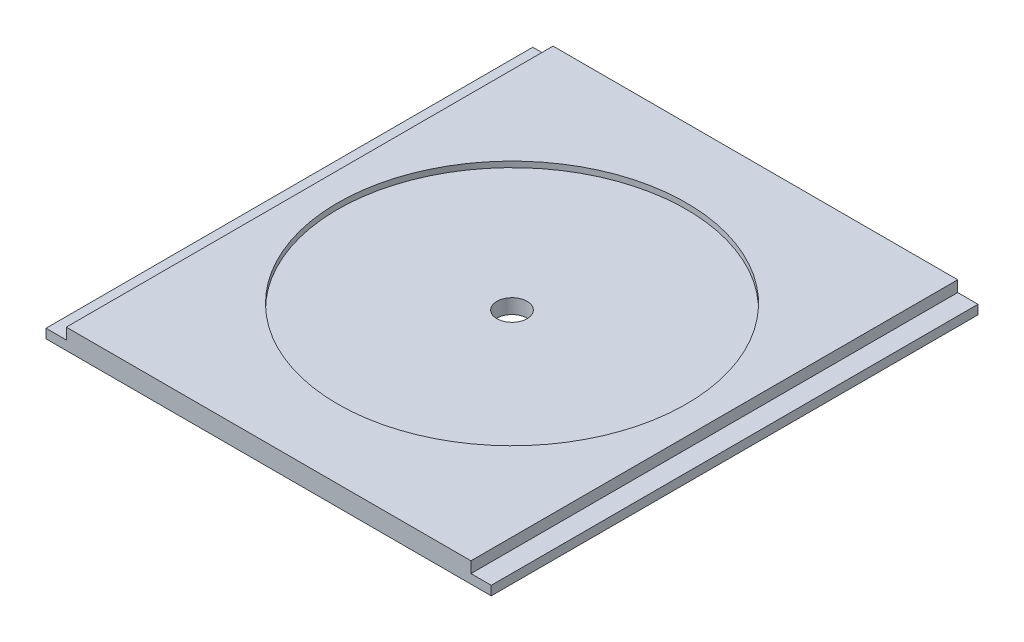
ISO-10303-21;
HEADER;
FILE_DESCRIPTION(('STEP AP214'),'2;1');
FILE_NAME('part.step','',(''),(''),'','','');
FILE_SCHEMA(('AUTOMOTIVE_DESIGN { 1 0 10303 214 1 1 1 1 }'));
ENDSEC;
DATA;
#1=APPLICATION_CONTEXT('core data for automotive mechanical design processes');
#2=APPLICATION_PROTOCOL_DEFINITION('international standard','automotive_design',2000,#1);
#3=PRODUCT_CONTEXT('',#1,'mechanical');
#4=PRODUCT('Part','Part','',(#3));
#5=PRODUCT_RELATED_PRODUCT_CATEGORY('part','',(#4));
#6=PRODUCT_DEFINITION_FORMATION('','',#4);
#7=PRODUCT_DEFINITION_CONTEXT('part definition',#1,'design');
#8=PRODUCT_DEFINITION('design','',#6,#7);
#9=PRODUCT_DEFINITION_SHAPE('','',#8);
#10=(LENGTH_UNIT() NAMED_UNIT(*) SI_UNIT(.MILLI.,.METRE.));
#11=(NAMED_UNIT(*) PLANE_ANGLE_UNIT() SI_UNIT($,.RADIAN.));
#12=(NAMED_UNIT(*) SI_UNIT($,.STERADIAN.) SOLID_ANGLE_UNIT());
#13=UNCERTAINTY_MEASURE_WITH_UNIT(LENGTH_MEASURE(1.E-05),#10,'distance_accuracy_value','');
#14=(GEOMETRIC_REPRESENTATION_CONTEXT(3) GLOBAL_UNCERTAINTY_ASSIGNED_CONTEXT((#13)) GLOBAL_UNIT_ASSIGNED_CONTEXT((#10,
#11,#12)) REPRESENTATION_CONTEXT('',''));
#15=CARTESIAN_POINT('',(0.,0.,0.));
#16=DIRECTION('',(0.,0.,1.));
#17=DIRECTION('',(1.,0.,0.));
#18=AXIS2_PLACEMENT_3D('',#15,#16,#17);
#19=CARTESIAN_POINT('',(0.,6.35,0.));
#20=DIRECTION('',(1.,0.,0.));
#21=DIRECTION('',(0.,0.,-1.));
#22=AXIS2_PLACEMENT_3D('',#19,#20,#21);
#23=PLANE('',#22);
#24=DIRECTION('',(0.,0.,1.));
#25=VECTOR('',#24,1.);
#26=CARTESIAN_POINT('',(0.,2.87528,-152.4));
#27=LINE('',#26,#25);
#28=CARTESIAN_POINT('',(0.,2.87528,-152.4));
#29=VERTEX_POINT('',#28);
#30=CARTESIAN_POINT('',(0.,2.87528,0.));
#31=VERTEX_POINT('',#30);
#32=EDGE_CURVE('E101',#29,#31,#27,.T.);
#33=ORIENTED_EDGE('',*,*,#32,.F.);
#34=DIRECTION('',(0.,-1.,0.));
#35=VECTOR('',#34,1.);
#36=CARTESIAN_POINT('',(0.,6.35,-152.4));
#37=LINE('',#36,#35);
#38=CARTESIAN_POINT('',(0.,0.,-152.4));
#39=VERTEX_POINT('',#38);
#40=EDGE_CURVE('E123',#29,#39,#37,.T.);
#41=ORIENTED_EDGE('',*,*,#40,.T.);
#42=DIRECTION('',(0.,0.,1.));
#43=VECTOR('',#42,1.);
#44=CARTESIAN_POINT('',(0.,0.,0.));
#45=LINE('',#44,#43);
#46=CARTESIAN_POINT('',(0.,0.,0.));
#47=VERTEX_POINT('',#46);
#48=EDGE_CURVE('E122',#39,#47,#45,.T.);
#49=ORIENTED_EDGE('',*,*,#48,.T.);
#50=DIRECTION('',(0.,-1.,0.));
#51=VECTOR('',#50,1.);
#52=CARTESIAN_POINT('',(0.,6.35,0.));
#53=LINE('',#52,#51);
#54=EDGE_CURVE('E11',#31,#47,#53,.T.);
#55=ORIENTED_EDGE('',*,*,#54,.F.);
#56=EDGE_LOOP('',(#33,#41,#49,#55));
#57=FACE_BOUND('',#56,.T.);
#58=ADVANCED_FACE('F38',(#57),#23,.F.);
#59=CARTESIAN_POINT('',(0.,6.35,0.));
#60=DIRECTION('',(0.,0.,-1.));
#61=DIRECTION('',(-1.,0.,0.));
#62=AXIS2_PLACEMENT_3D('',#59,#60,#61);
#63=PLANE('',#62);
#64=DIRECTION('',(1.,0.,0.));
#65=VECTOR('',#64,1.);
#66=CARTESIAN_POINT('',(0.,6.35,0.));
#67=LINE('',#66,#65);
#68=CARTESIAN_POINT('',(6.35000000000002,6.35,0.));
#69=VERTEX_POINT('',#68);
#70=CARTESIAN_POINT('',(133.05028,6.35,0.));
#71=VERTEX_POINT('',#70);
#72=EDGE_CURVE('E142',#69,#71,#67,.T.);
#73=ORIENTED_EDGE('',*,*,#72,.F.);
#74=DIRECTION('',(0.,1.,0.));
#75=VECTOR('',#74,1.);
#76=CARTESIAN_POINT('',(6.35000000000002,2.87528,0.));
#77=LINE('',#76,#75);
#78=CARTESIAN_POINT('',(6.35000000000002,2.87528,0.));
#79=VERTEX_POINT('',#78);
#80=EDGE_CURVE('E60',#79,#69,#77,.T.);
#81=ORIENTED_EDGE('',*,*,#80,.F.);
#82=DIRECTION('',(1.,0.,0.));
#83=VECTOR('',#82,1.);
#84=CARTESIAN_POINT('',(0.,2.87528,0.));
#85=LINE('',#84,#83);
#86=EDGE_CURVE('E105',#31,#79,#85,.T.);
#87=ORIENTED_EDGE('',*,*,#86,.F.);
#88=ORIENTED_EDGE('',*,*,#54,.T.);
#89=DIRECTION('',(1.,0.,0.));
#90=VECTOR('',#89,1.);
#91=CARTESIAN_POINT('',(0.,0.,0.));
#92=LINE('',#91,#90);
#93=CARTESIAN_POINT('',(139.40028,0.,0.));
#94=VERTEX_POINT('',#93);
#95=EDGE_CURVE('E127',#47,#94,#92,.T.);
#96=ORIENTED_EDGE('',*,*,#95,.T.);
#97=DIRECTION('',(0.,-1.,0.));
#98=VECTOR('',#97,1.);
#99=CARTESIAN_POINT('',(139.40028,6.35,0.));
#100=LINE('',#99,#98);
#101=CARTESIAN_POINT('',(139.40028,2.87528,0.));
#102=VERTEX_POINT('',#101);
#103=EDGE_CURVE('E45',#102,#94,#100,.T.);
#104=ORIENTED_EDGE('',*,*,#103,.F.);
#105=DIRECTION('',(1.,0.,0.));
#106=VECTOR('',#105,1.);
#107=CARTESIAN_POINT('',(139.40028,2.87528,0.));
#108=LINE('',#107,#106);
#109=CARTESIAN_POINT('',(133.05028,2.87528,0.));
#110=VERTEX_POINT('',#109);
#111=EDGE_CURVE('E164',#110,#102,#108,.T.);
#112=ORIENTED_EDGE('',*,*,#111,.F.);
#113=DIRECTION('',(0.,1.,0.));
#114=VECTOR('',#113,1.);
#115=CARTESIAN_POINT('',(133.05028,2.87528,0.));
#116=LINE('',#115,#114);
#117=EDGE_CURVE('E173',#110,#71,#116,.T.);
#118=ORIENTED_EDGE('',*,*,#117,.T.);
#119=EDGE_LOOP('',(#73,#81,#87,#88,#96,#104,#112,#118));
#120=FACE_BOUND('',#119,.T.);
#121=ADVANCED_FACE('F115',(#120),#63,.F.);
#122=CARTESIAN_POINT('',(139.40028,6.35,0.));
#123=DIRECTION('',(-1.,0.,0.));
#124=DIRECTION('',(0.,0.,1.));
#125=AXIS2_PLACEMENT_3D('',#122,#123,#124);
#126=PLANE('',#125);
#127=DIRECTION('',(0.,-1.,0.));
#128=VECTOR('',#127,1.);
#129=CARTESIAN_POINT('',(139.40028,6.35,-152.4));
#130=LINE('',#129,#128);
#131=CARTESIAN_POINT('',(139.40028,2.87528,-152.4));
#132=VERTEX_POINT('',#131);
#133=CARTESIAN_POINT('',(139.40028,0.,-152.4));
#134=VERTEX_POINT('',#133);
#135=EDGE_CURVE('E144',#132,#134,#130,.T.);
#136=ORIENTED_EDGE('',*,*,#135,.F.);
#137=DIRECTION('',(0.,0.,-1.));
#138=VECTOR('',#137,1.);
#139=CARTESIAN_POINT('',(139.40028,2.87528,-152.4));
#140=LINE('',#139,#138);
#141=EDGE_CURVE('E151',#102,#132,#140,.T.);
#142=ORIENTED_EDGE('',*,*,#141,.F.);
#143=ORIENTED_EDGE('',*,*,#103,.T.);
#144=DIRECTION('',(0.,0.,-1.));
#145=VECTOR('',#144,1.);
#146=CARTESIAN_POINT('',(139.40028,0.,0.));
#147=LINE('',#146,#145);
#148=EDGE_CURVE('E130',#94,#134,#147,.T.);
#149=ORIENTED_EDGE('',*,*,#148,.T.);
#150=EDGE_LOOP('',(#136,#142,#143,#149));
#151=FACE_BOUND('',#150,.T.);
#152=ADVANCED_FACE('F149',(#151),#126,.F.);
#153=CARTESIAN_POINT('',(0.,6.35,-152.4));
#154=DIRECTION('',(0.,0.,1.));
#155=DIRECTION('',(1.,0.,0.));
#156=AXIS2_PLACEMENT_3D('',#153,#154,#155);
#157=PLANE('',#156);
#158=DIRECTION('',(-1.,0.,0.));
#159=VECTOR('',#158,1.);
#160=CARTESIAN_POINT('',(0.,2.87528,-152.4));
#161=LINE('',#160,#159);
#162=CARTESIAN_POINT('',(6.35,2.87528,-152.4));
#163=VERTEX_POINT('',#162);
#164=EDGE_CURVE('E107',#163,#29,#161,.T.);
#165=ORIENTED_EDGE('',*,*,#164,.F.);
#166=DIRECTION('',(0.,1.,0.));
#167=VECTOR('',#166,1.);
#168=CARTESIAN_POINT('',(6.35,2.87528,-152.4));
#169=LINE('',#168,#167);
#170=CARTESIAN_POINT('',(6.35,6.35,-152.4));
#171=VERTEX_POINT('',#170);
#172=EDGE_CURVE('E128',#163,#171,#169,.T.);
#173=ORIENTED_EDGE('',*,*,#172,.T.);
#174=DIRECTION('',(-1.,0.,0.));
#175=VECTOR('',#174,1.);
#176=CARTESIAN_POINT('',(0.,6.35,-152.4));
#177=LINE('',#176,#175);
#178=CARTESIAN_POINT('',(133.05028,6.35,-152.4));
#179=VERTEX_POINT('',#178);
#180=EDGE_CURVE('E135',#179,#171,#177,.T.);
#181=ORIENTED_EDGE('',*,*,#180,.F.);
#182=DIRECTION('',(0.,1.,0.));
#183=VECTOR('',#182,1.);
#184=CARTESIAN_POINT('',(133.05028,2.87528,-152.4));
#185=LINE('',#184,#183);
#186=CARTESIAN_POINT('',(133.05028,2.87528,-152.4));
#187=VERTEX_POINT('',#186);
#188=EDGE_CURVE('E52',#187,#179,#185,.T.);
#189=ORIENTED_EDGE('',*,*,#188,.F.);
#190=DIRECTION('',(-1.,0.,0.));
#191=VECTOR('',#190,1.);
#192=CARTESIAN_POINT('',(139.40028,2.87528,-152.4));
#193=LINE('',#192,#191);
#194=EDGE_CURVE('E158',#132,#187,#193,.T.);
#195=ORIENTED_EDGE('',*,*,#194,.F.);
#196=ORIENTED_EDGE('',*,*,#135,.T.);
#197=DIRECTION('',(-1.,0.,0.));
#198=VECTOR('',#197,1.);
#199=CARTESIAN_POINT('',(0.,0.,-152.4));
#200=LINE('',#199,#198);
#201=EDGE_CURVE('E140',#134,#39,#200,.T.);
#202=ORIENTED_EDGE('',*,*,#201,.T.);
#203=ORIENTED_EDGE('',*,*,#40,.F.);
#204=EDGE_LOOP('',(#165,#173,#181,#189,#195,#196,#202,#203));
#205=FACE_BOUND('',#204,.T.);
#206=ADVANCED_FACE('F155',(#205),#157,.F.);
#207=CARTESIAN_POINT('',(0.,6.35,0.));
#208=DIRECTION('',(0.,-1.,0.));
#209=DIRECTION('',(0.,0.,-1.));
#210=AXIS2_PLACEMENT_3D('',#207,#208,#209);
#211=PLANE('',#210);
#212=CARTESIAN_POINT('',(69.70014,6.35,-76.2));
#213=DIRECTION('',(0.,1.,0.));
#214=DIRECTION('',(0.,0.,1.));
#215=AXIS2_PLACEMENT_3D('',#212,#213,#214);
#216=CIRCLE('',#215,54.58206);
#217=CARTESIAN_POINT('',(69.70014,6.35,-21.61794));
#218=VERTEX_POINT('',#217);
#219=EDGE_CURVE('E185',#218,#218,#216,.T.);
#220=ORIENTED_EDGE('',*,*,#219,.F.);
#221=EDGE_LOOP('',(#220));
#222=FACE_BOUND('',#221,.T.);
#223=ORIENTED_EDGE('',*,*,#180,.T.);
#224=DIRECTION('',(0.,0.,-1.));
#225=VECTOR('',#224,1.);
#226=CARTESIAN_POINT('',(6.35,6.35,-152.4));
#227=LINE('',#226,#225);
#228=EDGE_CURVE('E111',#69,#171,#227,.T.);
#229=ORIENTED_EDGE('',*,*,#228,.F.);
#230=ORIENTED_EDGE('',*,*,#72,.T.);
#231=DIRECTION('',(0.,0.,1.));
#232=VECTOR('',#231,1.);
#233=CARTESIAN_POINT('',(133.05028,6.35,-152.4));
#234=LINE('',#233,#232);
#235=EDGE_CURVE('E166',#179,#71,#234,.T.);
#236=ORIENTED_EDGE('',*,*,#235,.F.);
#237=EDGE_LOOP('',(#223,#229,#230,#236));
#238=FACE_BOUND('',#237,.T.);
#239=ADVANCED_FACE('F179',(#222,#238),#211,.F.);
#240=CARTESIAN_POINT('',(0.,0.,0.));
#241=DIRECTION('',(0.,-1.,0.));
#242=DIRECTION('',(0.,0.,-1.));
#243=AXIS2_PLACEMENT_3D('',#240,#241,#242);
#244=PLANE('',#243);
#245=CARTESIAN_POINT('',(69.70014,0.,-76.2));
#246=DIRECTION('',(0.,1.,0.));
#247=DIRECTION('',(0.,0.,1.));
#248=AXIS2_PLACEMENT_3D('',#245,#246,#247);
#249=CIRCLE('',#248,4.72186);
#250=CARTESIAN_POINT('',(69.70014,0.,-71.47814));
#251=VERTEX_POINT('',#250);
#252=EDGE_CURVE('E188',#251,#251,#249,.T.);
#253=ORIENTED_EDGE('',*,*,#252,.T.);
#254=EDGE_LOOP('',(#253));
#255=FACE_BOUND('',#254,.T.);
#256=ORIENTED_EDGE('',*,*,#48,.F.);
#257=ORIENTED_EDGE('',*,*,#201,.F.);
#258=ORIENTED_EDGE('',*,*,#148,.F.);
#259=ORIENTED_EDGE('',*,*,#95,.F.);
#260=EDGE_LOOP('',(#256,#257,#258,#259));
#261=FACE_BOUND('',#260,.T.);
#262=ADVANCED_FACE('F153',(#255,#261),#244,.T.);
#263=CARTESIAN_POINT('',(133.05028,2.87528,-152.4));
#264=DIRECTION('',(-1.,0.,0.));
#265=DIRECTION('',(0.,0.,1.));
#266=AXIS2_PLACEMENT_3D('',#263,#264,#265);
#267=PLANE('',#266);
#268=ORIENTED_EDGE('',*,*,#235,.T.);
#269=ORIENTED_EDGE('',*,*,#117,.F.);
#270=DIRECTION('',(0.,0.,1.));
#271=VECTOR('',#270,1.);
#272=CARTESIAN_POINT('',(133.05028,2.87528,-152.4));
#273=LINE('',#272,#271);
#274=EDGE_CURVE('E162',#187,#110,#273,.T.);
#275=ORIENTED_EDGE('',*,*,#274,.F.);
#276=ORIENTED_EDGE('',*,*,#188,.T.);
#277=EDGE_LOOP('',(#268,#269,#275,#276));
#278=FACE_BOUND('',#277,.T.);
#279=ADVANCED_FACE('F222',(#278),#267,.F.);
#280=CARTESIAN_POINT('',(0.,2.87528,0.));
#281=DIRECTION('',(0.,-1.,0.));
#282=DIRECTION('',(0.,0.,-1.));
#283=AXIS2_PLACEMENT_3D('',#280,#281,#282);
#284=PLANE('',#283);
#285=ORIENTED_EDGE('',*,*,#141,.T.);
#286=ORIENTED_EDGE('',*,*,#194,.T.);
#287=ORIENTED_EDGE('',*,*,#274,.T.);
#288=ORIENTED_EDGE('',*,*,#111,.T.);
#289=EDGE_LOOP('',(#285,#286,#287,#288));
#290=FACE_BOUND('',#289,.T.);
#291=ADVANCED_FACE('F250',(#290),#284,.F.);
#292=CARTESIAN_POINT('',(6.35,2.87528,-152.4));
#293=DIRECTION('',(1.,0.,0.));
#294=DIRECTION('',(0.,0.,-1.));
#295=AXIS2_PLACEMENT_3D('',#292,#293,#294);
#296=PLANE('',#295);
#297=ORIENTED_EDGE('',*,*,#228,.T.);
#298=ORIENTED_EDGE('',*,*,#172,.F.);
#299=DIRECTION('',(0.,0.,-1.));
#300=VECTOR('',#299,1.);
#301=CARTESIAN_POINT('',(6.35,2.87528,-152.4));
#302=LINE('',#301,#300);
#303=EDGE_CURVE('E118',#79,#163,#302,.T.);
#304=ORIENTED_EDGE('',*,*,#303,.F.);
#305=ORIENTED_EDGE('',*,*,#80,.T.);
#306=EDGE_LOOP('',(#297,#298,#304,#305));
#307=FACE_BOUND('',#306,.T.);
#308=ADVANCED_FACE('F180',(#307),#296,.F.);
#309=CARTESIAN_POINT('',(0.,2.87528,0.));
#310=DIRECTION('',(0.,1.,0.));
#311=DIRECTION('',(0.,0.,1.));
#312=AXIS2_PLACEMENT_3D('',#309,#310,#311);
#313=PLANE('',#312);
#314=ORIENTED_EDGE('',*,*,#32,.T.);
#315=ORIENTED_EDGE('',*,*,#86,.T.);
#316=ORIENTED_EDGE('',*,*,#303,.T.);
#317=ORIENTED_EDGE('',*,*,#164,.T.);
#318=EDGE_LOOP('',(#314,#315,#316,#317));
#319=FACE_BOUND('',#318,.T.);
#320=ADVANCED_FACE('F103',(#319),#313,.T.);
#321=CARTESIAN_POINT('',(69.70014,4.572,-76.2));
#322=DIRECTION('',(0.,1.,0.));
#323=DIRECTION('',(0.,0.,1.));
#324=AXIS2_PLACEMENT_3D('',#321,#322,#323);
#325=CYLINDRICAL_SURFACE('',#324,54.58206);
#326=CARTESIAN_POINT('',(69.70014,4.572,-76.2));
#327=DIRECTION('',(0.,1.,0.));
#328=DIRECTION('',(0.,0.,1.));
#329=AXIS2_PLACEMENT_3D('',#326,#327,#328);
#330=CIRCLE('',#329,54.58206);
#331=CARTESIAN_POINT('',(69.70014,4.572,-21.61794));
#332=VERTEX_POINT('',#331);
#333=EDGE_CURVE('E172',#332,#332,#330,.T.);
#334=ORIENTED_EDGE('',*,*,#333,.F.);
#335=EDGE_LOOP('',(#334));
#336=FACE_BOUND('',#335,.T.);
#337=ORIENTED_EDGE('',*,*,#219,.T.);
#338=EDGE_LOOP('',(#337));
#339=FACE_BOUND('',#338,.T.);
#340=ADVANCED_FACE('F207',(#336,#339),#325,.F.);
#341=CARTESIAN_POINT('',(69.70014,4.572,-76.2));
#342=DIRECTION('',(0.,1.,0.));
#343=DIRECTION('',(0.,0.,1.));
#344=AXIS2_PLACEMENT_3D('',#341,#342,#343);
#345=PLANE('',#344);
#346=CARTESIAN_POINT('',(69.70014,4.572,-76.2));
#347=DIRECTION('',(0.,1.,0.));
#348=DIRECTION('',(0.,0.,1.));
#349=AXIS2_PLACEMENT_3D('',#346,#347,#348);
#350=CIRCLE('',#349,4.72186);
#351=CARTESIAN_POINT('',(69.70014,4.572,-71.47814));
#352=VERTEX_POINT('',#351);
#353=EDGE_CURVE('E191',#352,#352,#350,.T.);
#354=ORIENTED_EDGE('',*,*,#353,.F.);
#355=EDGE_LOOP('',(#354));
#356=FACE_BOUND('',#355,.T.);
#357=ORIENTED_EDGE('',*,*,#333,.T.);
#358=EDGE_LOOP('',(#357));
#359=FACE_BOUND('',#358,.T.);
#360=ADVANCED_FACE('F201',(#356,#359),#345,.T.);
#361=CARTESIAN_POINT('',(69.70014,0.,-76.2));
#362=DIRECTION('',(0.,1.,0.));
#363=DIRECTION('',(0.,0.,1.));
#364=AXIS2_PLACEMENT_3D('',#361,#362,#363);
#365=CYLINDRICAL_SURFACE('',#364,4.72186);
#366=ORIENTED_EDGE('',*,*,#252,.F.);
#367=EDGE_LOOP('',(#366));
#368=FACE_BOUND('',#367,.T.);
#369=ORIENTED_EDGE('',*,*,#353,.T.);
#370=EDGE_LOOP('',(#369));
#371=FACE_BOUND('',#370,.T.);
#372=ADVANCED_FACE('F198',(#368,#371),#365,.F.);
#373=CLOSED_SHELL('',(#58,#121,#152,#206,#239,#262,#279,#291,#308,#320,#340,#360,#372));
#374=MANIFOLD_SOLID_BREP('B2',#373);
#375=ADVANCED_BREP_SHAPE_REPRESENTATION('',(#18,#374),#14);
#376=SHAPE_DEFINITION_REPRESENTATION(#9,#375);
ENDSEC;
END-ISO-10303-21;
